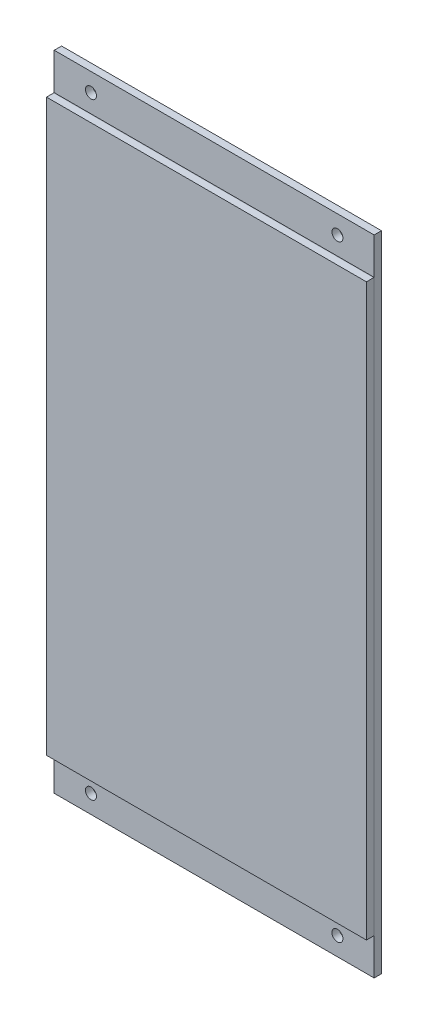
ISO-10303-21;
HEADER;
FILE_DESCRIPTION(('STEP AP214'),'2;1');
FILE_NAME('part.step','',(''),(''),'','','');
FILE_SCHEMA(('AUTOMOTIVE_DESIGN { 1 0 10303 214 1 1 1 1 }'));
ENDSEC;
DATA;
#1=APPLICATION_CONTEXT('core data for automotive mechanical design processes');
#2=APPLICATION_PROTOCOL_DEFINITION('international standard','automotive_design',2000,#1);
#3=PRODUCT_CONTEXT('',#1,'mechanical');
#4=PRODUCT('Part','Part','',(#3));
#5=PRODUCT_RELATED_PRODUCT_CATEGORY('part','',(#4));
#6=PRODUCT_DEFINITION_FORMATION('','',#4);
#7=PRODUCT_DEFINITION_CONTEXT('part definition',#1,'design');
#8=PRODUCT_DEFINITION('design','',#6,#7);
#9=PRODUCT_DEFINITION_SHAPE('','',#8);
#10=(LENGTH_UNIT() NAMED_UNIT(*) SI_UNIT(.MILLI.,.METRE.));
#11=(NAMED_UNIT(*) PLANE_ANGLE_UNIT() SI_UNIT($,.RADIAN.));
#12=(NAMED_UNIT(*) SI_UNIT($,.STERADIAN.) SOLID_ANGLE_UNIT());
#13=UNCERTAINTY_MEASURE_WITH_UNIT(LENGTH_MEASURE(1.E-05),#10,'distance_accuracy_value','');
#14=(GEOMETRIC_REPRESENTATION_CONTEXT(3) GLOBAL_UNCERTAINTY_ASSIGNED_CONTEXT((#13)) GLOBAL_UNIT_ASSIGNED_CONTEXT((#10,
#11,#12)) REPRESENTATION_CONTEXT('',''));
#15=CARTESIAN_POINT('',(0.,0.,0.));
#16=DIRECTION('',(0.,0.,1.));
#17=DIRECTION('',(1.,0.,0.));
#18=AXIS2_PLACEMENT_3D('',#15,#16,#17);
#19=CARTESIAN_POINT('',(-16.521568627451,37.4671078431373,-2.1));
#20=DIRECTION('',(1.,0.,0.));
#21=DIRECTION('',(0.,1.,0.));
#22=AXIS2_PLACEMENT_3D('',#19,#20,#21);
#23=PLANE('',#22);
#24=DIRECTION('',(0.,1.,0.));
#25=VECTOR('',#24,1.);
#26=CARTESIAN_POINT('',(-16.521568627451,37.4671078431373,-0.1));
#27=LINE('',#26,#25);
#28=CARTESIAN_POINT('',(-16.521568627451,-137.732892156863,-0.1));
#29=VERTEX_POINT('',#28);
#30=CARTESIAN_POINT('',(-16.521568627451,37.4671078431373,-0.1));
#31=VERTEX_POINT('',#30);
#32=EDGE_CURVE('E123',#29,#31,#27,.T.);
#33=ORIENTED_EDGE('',*,*,#32,.T.);
#34=DIRECTION('',(0.,0.,1.));
#35=VECTOR('',#34,1.);
#36=CARTESIAN_POINT('',(-16.521568627451,37.4671078431373,-2.1));
#37=LINE('',#36,#35);
#38=CARTESIAN_POINT('',(-16.521568627451,37.4671078431373,-2.1));
#39=VERTEX_POINT('',#38);
#40=EDGE_CURVE('E12',#39,#31,#37,.T.);
#41=ORIENTED_EDGE('',*,*,#40,.F.);
#42=DIRECTION('',(0.,1.,0.));
#43=VECTOR('',#42,1.);
#44=CARTESIAN_POINT('',(-16.521568627451,37.4671078431373,-2.1));
#45=LINE('',#44,#43);
#46=CARTESIAN_POINT('',(-16.521568627451,-137.732892156863,-2.1));
#47=VERTEX_POINT('',#46);
#48=EDGE_CURVE('E107',#47,#39,#45,.T.);
#49=ORIENTED_EDGE('',*,*,#48,.F.);
#50=DIRECTION('',(0.,0.,1.));
#51=VECTOR('',#50,1.);
#52=CARTESIAN_POINT('',(-16.521568627451,-137.732892156863,-2.1));
#53=LINE('',#52,#51);
#54=EDGE_CURVE('E119',#47,#29,#53,.T.);
#55=ORIENTED_EDGE('',*,*,#54,.T.);
#56=EDGE_LOOP('',(#33,#41,#49,#55));
#57=FACE_BOUND('',#56,.T.);
#58=ADVANCED_FACE('F55',(#57),#23,.F.);
#59=CARTESIAN_POINT('',(70.578431372549,37.4671078431373,-2.1));
#60=DIRECTION('',(0.,-1.,0.));
#61=DIRECTION('',(0.,0.,-1.));
#62=AXIS2_PLACEMENT_3D('',#59,#60,#61);
#63=PLANE('',#62);
#64=DIRECTION('',(1.,0.,0.));
#65=VECTOR('',#64,1.);
#66=CARTESIAN_POINT('',(70.578431372549,37.4671078431373,-0.1));
#67=LINE('',#66,#65);
#68=CARTESIAN_POINT('',(70.578431372549,37.4671078431373,-0.1));
#69=VERTEX_POINT('',#68);
#70=EDGE_CURVE('E112',#31,#69,#67,.T.);
#71=ORIENTED_EDGE('',*,*,#70,.T.);
#72=DIRECTION('',(0.,0.,1.));
#73=VECTOR('',#72,1.);
#74=CARTESIAN_POINT('',(70.578431372549,37.4671078431373,-2.1));
#75=LINE('',#74,#73);
#76=CARTESIAN_POINT('',(70.578431372549,37.4671078431373,-2.1));
#77=VERTEX_POINT('',#76);
#78=EDGE_CURVE('E64',#77,#69,#75,.T.);
#79=ORIENTED_EDGE('',*,*,#78,.F.);
#80=DIRECTION('',(1.,0.,0.));
#81=VECTOR('',#80,1.);
#82=CARTESIAN_POINT('',(70.578431372549,37.4671078431373,-2.1));
#83=LINE('',#82,#81);
#84=EDGE_CURVE('E102',#39,#77,#83,.T.);
#85=ORIENTED_EDGE('',*,*,#84,.F.);
#86=ORIENTED_EDGE('',*,*,#40,.T.);
#87=EDGE_LOOP('',(#71,#79,#85,#86));
#88=FACE_BOUND('',#87,.T.);
#89=ADVANCED_FACE('F111',(#88),#63,.F.);
#90=CARTESIAN_POINT('',(70.578431372549,37.4671078431373,-2.1));
#91=DIRECTION('',(-1.,0.,0.));
#92=DIRECTION('',(0.,-1.,0.));
#93=AXIS2_PLACEMENT_3D('',#90,#91,#92);
#94=PLANE('',#93);
#95=DIRECTION('',(0.,-1.,0.));
#96=VECTOR('',#95,1.);
#97=CARTESIAN_POINT('',(70.578431372549,37.4671078431373,-0.1));
#98=LINE('',#97,#96);
#99=CARTESIAN_POINT('',(70.578431372549,-137.732892156863,-0.1));
#100=VERTEX_POINT('',#99);
#101=EDGE_CURVE('E89',#69,#100,#98,.T.);
#102=ORIENTED_EDGE('',*,*,#101,.T.);
#103=DIRECTION('',(0.,0.,1.));
#104=VECTOR('',#103,1.);
#105=CARTESIAN_POINT('',(70.578431372549,-137.732892156863,-2.1));
#106=LINE('',#105,#104);
#107=CARTESIAN_POINT('',(70.578431372549,-137.732892156863,-2.1));
#108=VERTEX_POINT('',#107);
#109=EDGE_CURVE('E114',#108,#100,#106,.T.);
#110=ORIENTED_EDGE('',*,*,#109,.F.);
#111=DIRECTION('',(0.,-1.,0.));
#112=VECTOR('',#111,1.);
#113=CARTESIAN_POINT('',(70.578431372549,37.4671078431373,-2.1));
#114=LINE('',#113,#112);
#115=EDGE_CURVE('E105',#77,#108,#114,.T.);
#116=ORIENTED_EDGE('',*,*,#115,.F.);
#117=ORIENTED_EDGE('',*,*,#78,.T.);
#118=EDGE_LOOP('',(#102,#110,#116,#117));
#119=FACE_BOUND('',#118,.T.);
#120=ADVANCED_FACE('F115',(#119),#94,.F.);
#121=CARTESIAN_POINT('',(70.578431372549,-137.732892156863,-2.1));
#122=DIRECTION('',(0.,1.,0.));
#123=DIRECTION('',(0.,0.,1.));
#124=AXIS2_PLACEMENT_3D('',#121,#122,#123);
#125=PLANE('',#124);
#126=DIRECTION('',(-1.,0.,0.));
#127=VECTOR('',#126,1.);
#128=CARTESIAN_POINT('',(70.578431372549,-137.732892156863,-0.1));
#129=LINE('',#128,#127);
#130=EDGE_CURVE('E95',#100,#29,#129,.T.);
#131=ORIENTED_EDGE('',*,*,#130,.T.);
#132=ORIENTED_EDGE('',*,*,#54,.F.);
#133=DIRECTION('',(-1.,0.,0.));
#134=VECTOR('',#133,1.);
#135=CARTESIAN_POINT('',(70.578431372549,-137.732892156863,-2.1));
#136=LINE('',#135,#134);
#137=EDGE_CURVE('E72',#108,#47,#136,.T.);
#138=ORIENTED_EDGE('',*,*,#137,.F.);
#139=ORIENTED_EDGE('',*,*,#109,.T.);
#140=EDGE_LOOP('',(#131,#132,#138,#139));
#141=FACE_BOUND('',#140,.T.);
#142=ADVANCED_FACE('F137',(#141),#125,.F.);
#143=CARTESIAN_POINT('',(0.,0.,-2.1));
#144=DIRECTION('',(0.,0.,-1.));
#145=DIRECTION('',(-1.,0.,0.));
#146=AXIS2_PLACEMENT_3D('',#143,#144,#145);
#147=PLANE('',#146);
#148=CARTESIAN_POINT('',(60.578431372549,32.4671078431373,-2.1));
#149=DIRECTION('',(0.,0.,1.));
#150=DIRECTION('',(1.,0.,0.));
#151=AXIS2_PLACEMENT_3D('',#148,#149,#150);
#152=CIRCLE('',#151,1.5);
#153=CARTESIAN_POINT('',(62.078431372549,32.4671078431373,-2.1));
#154=VERTEX_POINT('',#153);
#155=EDGE_CURVE('E161',#154,#154,#152,.T.);
#156=ORIENTED_EDGE('',*,*,#155,.T.);
#157=EDGE_LOOP('',(#156));
#158=FACE_BOUND('',#157,.T.);
#159=CARTESIAN_POINT('',(-6.52156862745098,-132.732892156863,-2.1));
#160=DIRECTION('',(0.,0.,1.));
#161=DIRECTION('',(1.,0.,0.));
#162=AXIS2_PLACEMENT_3D('',#159,#160,#161);
#163=CIRCLE('',#162,1.5);
#164=CARTESIAN_POINT('',(-5.02156862745098,-132.732892156863,-2.1));
#165=VERTEX_POINT('',#164);
#166=EDGE_CURVE('E152',#165,#165,#163,.T.);
#167=ORIENTED_EDGE('',*,*,#166,.T.);
#168=EDGE_LOOP('',(#167));
#169=FACE_BOUND('',#168,.T.);
#170=CARTESIAN_POINT('',(60.578431372549,-132.732892156863,-2.1));
#171=DIRECTION('',(0.,0.,1.));
#172=DIRECTION('',(1.,0.,0.));
#173=AXIS2_PLACEMENT_3D('',#170,#171,#172);
#174=CIRCLE('',#173,1.5);
#175=CARTESIAN_POINT('',(62.078431372549,-132.732892156863,-2.1));
#176=VERTEX_POINT('',#175);
#177=EDGE_CURVE('E168',#176,#176,#174,.T.);
#178=ORIENTED_EDGE('',*,*,#177,.T.);
#179=EDGE_LOOP('',(#178));
#180=FACE_BOUND('',#179,.T.);
#181=CARTESIAN_POINT('',(-6.52156862745098,32.4671078431372,-2.1));
#182=DIRECTION('',(0.,0.,1.));
#183=DIRECTION('',(1.,0.,0.));
#184=AXIS2_PLACEMENT_3D('',#181,#182,#183);
#185=CIRCLE('',#184,1.5);
#186=CARTESIAN_POINT('',(-5.02156862745098,32.4671078431372,-2.1));
#187=VERTEX_POINT('',#186);
#188=EDGE_CURVE('E127',#187,#187,#185,.T.);
#189=ORIENTED_EDGE('',*,*,#188,.T.);
#190=EDGE_LOOP('',(#189));
#191=FACE_BOUND('',#190,.T.);
#192=ORIENTED_EDGE('',*,*,#48,.T.);
#193=ORIENTED_EDGE('',*,*,#84,.T.);
#194=ORIENTED_EDGE('',*,*,#115,.T.);
#195=ORIENTED_EDGE('',*,*,#137,.T.);
#196=EDGE_LOOP('',(#192,#193,#194,#195));
#197=FACE_BOUND('',#196,.T.);
#198=ADVANCED_FACE('F103',(#158,#169,#180,#191,#197),#147,.T.);
#199=CARTESIAN_POINT('',(0.,0.,-0.1));
#200=DIRECTION('',(0.,0.,-1.));
#201=DIRECTION('',(-1.,0.,0.));
#202=AXIS2_PLACEMENT_3D('',#199,#200,#201);
#203=PLANE('',#202);
#204=CARTESIAN_POINT('',(60.578431372549,32.4671078431373,-0.1));
#205=DIRECTION('',(0.,0.,1.));
#206=DIRECTION('',(1.,0.,0.));
#207=AXIS2_PLACEMENT_3D('',#204,#205,#206);
#208=CIRCLE('',#207,1.5);
#209=CARTESIAN_POINT('',(62.078431372549,32.4671078431373,-0.1));
#210=VERTEX_POINT('',#209);
#211=EDGE_CURVE('E148',#210,#210,#208,.T.);
#212=ORIENTED_EDGE('',*,*,#211,.F.);
#213=EDGE_LOOP('',(#212));
#214=FACE_BOUND('',#213,.T.);
#215=CARTESIAN_POINT('',(-6.52156862745098,-132.732892156863,-0.1));
#216=DIRECTION('',(0.,0.,1.));
#217=DIRECTION('',(1.,0.,0.));
#218=AXIS2_PLACEMENT_3D('',#215,#216,#217);
#219=CIRCLE('',#218,1.5);
#220=CARTESIAN_POINT('',(-5.02156862745098,-132.732892156863,-0.1));
#221=VERTEX_POINT('',#220);
#222=EDGE_CURVE('E156',#221,#221,#219,.T.);
#223=ORIENTED_EDGE('',*,*,#222,.F.);
#224=EDGE_LOOP('',(#223));
#225=FACE_BOUND('',#224,.T.);
#226=CARTESIAN_POINT('',(60.578431372549,-132.732892156863,-0.1));
#227=DIRECTION('',(0.,0.,1.));
#228=DIRECTION('',(1.,0.,0.));
#229=AXIS2_PLACEMENT_3D('',#226,#227,#228);
#230=CIRCLE('',#229,1.5);
#231=CARTESIAN_POINT('',(62.078431372549,-132.732892156863,-0.1));
#232=VERTEX_POINT('',#231);
#233=EDGE_CURVE('E157',#232,#232,#230,.T.);
#234=ORIENTED_EDGE('',*,*,#233,.F.);
#235=EDGE_LOOP('',(#234));
#236=FACE_BOUND('',#235,.T.);
#237=CARTESIAN_POINT('',(-6.52156862745098,32.4671078431372,-0.1));
#238=DIRECTION('',(0.,0.,1.));
#239=DIRECTION('',(1.,0.,0.));
#240=AXIS2_PLACEMENT_3D('',#237,#238,#239);
#241=CIRCLE('',#240,1.5);
#242=CARTESIAN_POINT('',(-5.02156862745098,32.4671078431372,-0.1));
#243=VERTEX_POINT('',#242);
#244=EDGE_CURVE('E144',#243,#243,#241,.T.);
#245=ORIENTED_EDGE('',*,*,#244,.F.);
#246=EDGE_LOOP('',(#245));
#247=FACE_BOUND('',#246,.T.);
#248=ORIENTED_EDGE('',*,*,#32,.F.);
#249=ORIENTED_EDGE('',*,*,#130,.F.);
#250=ORIENTED_EDGE('',*,*,#101,.F.);
#251=ORIENTED_EDGE('',*,*,#70,.F.);
#252=EDGE_LOOP('',(#248,#249,#250,#251));
#253=FACE_BOUND('',#252,.T.);
#254=ADVANCED_FACE('F140',(#214,#225,#236,#247,#253),#203,.F.);
#255=CARTESIAN_POINT('',(-6.52156862745098,32.4671078431372,-2.1));
#256=DIRECTION('',(0.,0.,1.));
#257=DIRECTION('',(1.,0.,0.));
#258=AXIS2_PLACEMENT_3D('',#255,#256,#257);
#259=CYLINDRICAL_SURFACE('',#258,1.5);
#260=ORIENTED_EDGE('',*,*,#188,.F.);
#261=EDGE_LOOP('',(#260));
#262=FACE_BOUND('',#261,.T.);
#263=ORIENTED_EDGE('',*,*,#244,.T.);
#264=EDGE_LOOP('',(#263));
#265=FACE_BOUND('',#264,.T.);
#266=ADVANCED_FACE('F180',(#262,#265),#259,.F.);
#267=CARTESIAN_POINT('',(60.578431372549,-132.732892156863,-2.1));
#268=DIRECTION('',(0.,0.,1.));
#269=DIRECTION('',(1.,0.,0.));
#270=AXIS2_PLACEMENT_3D('',#267,#268,#269);
#271=CYLINDRICAL_SURFACE('',#270,1.5);
#272=ORIENTED_EDGE('',*,*,#177,.F.);
#273=EDGE_LOOP('',(#272));
#274=FACE_BOUND('',#273,.T.);
#275=ORIENTED_EDGE('',*,*,#233,.T.);
#276=EDGE_LOOP('',(#275));
#277=FACE_BOUND('',#276,.T.);
#278=ADVANCED_FACE('F176',(#274,#277),#271,.F.);
#279=CARTESIAN_POINT('',(-6.52156862745098,-132.732892156863,-2.1));
#280=DIRECTION('',(0.,0.,1.));
#281=DIRECTION('',(1.,0.,0.));
#282=AXIS2_PLACEMENT_3D('',#279,#280,#281);
#283=CYLINDRICAL_SURFACE('',#282,1.5);
#284=ORIENTED_EDGE('',*,*,#166,.F.);
#285=EDGE_LOOP('',(#284));
#286=FACE_BOUND('',#285,.T.);
#287=ORIENTED_EDGE('',*,*,#222,.T.);
#288=EDGE_LOOP('',(#287));
#289=FACE_BOUND('',#288,.T.);
#290=ADVANCED_FACE('F192',(#286,#289),#283,.F.);
#291=CARTESIAN_POINT('',(60.578431372549,32.4671078431373,-2.1));
#292=DIRECTION('',(0.,0.,1.));
#293=DIRECTION('',(1.,0.,0.));
#294=AXIS2_PLACEMENT_3D('',#291,#292,#293);
#295=CYLINDRICAL_SURFACE('',#294,1.5);
#296=ORIENTED_EDGE('',*,*,#155,.F.);
#297=EDGE_LOOP('',(#296));
#298=FACE_BOUND('',#297,.T.);
#299=ORIENTED_EDGE('',*,*,#211,.T.);
#300=EDGE_LOOP('',(#299));
#301=FACE_BOUND('',#300,.T.);
#302=ADVANCED_FACE('F222',(#298,#301),#295,.F.);
#303=CLOSED_SHELL('',(#58,#89,#120,#142,#198,#254,#266,#278,#290,#302));
#304=MANIFOLD_SOLID_BREP('B2',#303);
#305=CARTESIAN_POINT('',(70.578431372549,27.4671078431373,-0.1));
#306=DIRECTION('',(-1.,0.,0.));
#307=DIRECTION('',(0.,0.,1.));
#308=AXIS2_PLACEMENT_3D('',#305,#306,#307);
#309=PLANE('',#308);
#310=DIRECTION('',(0.,-1.,0.));
#311=VECTOR('',#310,1.);
#312=CARTESIAN_POINT('',(70.578431372549,27.4671078431373,0.));
#313=LINE('',#312,#311);
#314=CARTESIAN_POINT('',(70.578431372549,27.4671078431373,0.));
#315=VERTEX_POINT('',#314);
#316=CARTESIAN_POINT('',(70.578431372549,-127.732892156863,0.));
#317=VERTEX_POINT('',#316);
#318=EDGE_CURVE('E374',#315,#317,#313,.T.);
#319=ORIENTED_EDGE('',*,*,#318,.T.);
#320=DIRECTION('',(0.,0.,1.));
#321=VECTOR('',#320,1.);
#322=CARTESIAN_POINT('',(70.578431372549,-127.732892156863,-0.1));
#323=LINE('',#322,#321);
#324=CARTESIAN_POINT('',(70.578431372549,-127.732892156863,-0.1));
#325=VERTEX_POINT('',#324);
#326=EDGE_CURVE('E53',#325,#317,#323,.T.);
#327=ORIENTED_EDGE('',*,*,#326,.F.);
#328=DIRECTION('',(0.,-1.,0.));
#329=VECTOR('',#328,1.);
#330=CARTESIAN_POINT('',(70.578431372549,27.4671078431373,-0.1));
#331=LINE('',#330,#329);
#332=CARTESIAN_POINT('',(70.578431372549,27.4671078431373,-0.1));
#333=VERTEX_POINT('',#332);
#334=EDGE_CURVE('E362',#333,#325,#331,.T.);
#335=ORIENTED_EDGE('',*,*,#334,.F.);
#336=DIRECTION('',(0.,0.,1.));
#337=VECTOR('',#336,1.);
#338=CARTESIAN_POINT('',(70.578431372549,27.4671078431373,-0.1));
#339=LINE('',#338,#337);
#340=EDGE_CURVE('E370',#333,#315,#339,.T.);
#341=ORIENTED_EDGE('',*,*,#340,.T.);
#342=EDGE_LOOP('',(#319,#327,#335,#341));
#343=FACE_BOUND('',#342,.T.);
#344=ADVANCED_FACE('F311',(#343),#309,.F.);
#345=CARTESIAN_POINT('',(70.578431372549,-127.732892156863,-0.1));
#346=DIRECTION('',(0.,1.,0.));
#347=DIRECTION('',(0.,0.,1.));
#348=AXIS2_PLACEMENT_3D('',#345,#346,#347);
#349=PLANE('',#348);
#350=DIRECTION('',(-1.,0.,0.));
#351=VECTOR('',#350,1.);
#352=CARTESIAN_POINT('',(70.578431372549,-127.732892156863,0.));
#353=LINE('',#352,#351);
#354=CARTESIAN_POINT('',(-16.521568627451,-127.732892156863,0.));
#355=VERTEX_POINT('',#354);
#356=EDGE_CURVE('E366',#317,#355,#353,.T.);
#357=ORIENTED_EDGE('',*,*,#356,.T.);
#358=DIRECTION('',(0.,0.,1.));
#359=VECTOR('',#358,1.);
#360=CARTESIAN_POINT('',(-16.521568627451,-127.732892156863,-0.1));
#361=LINE('',#360,#359);
#362=CARTESIAN_POINT('',(-16.521568627451,-127.732892156863,-0.1));
#363=VERTEX_POINT('',#362);
#364=EDGE_CURVE('E319',#363,#355,#361,.T.);
#365=ORIENTED_EDGE('',*,*,#364,.F.);
#366=DIRECTION('',(-1.,0.,0.));
#367=VECTOR('',#366,1.);
#368=CARTESIAN_POINT('',(70.578431372549,-127.732892156863,-0.1));
#369=LINE('',#368,#367);
#370=EDGE_CURVE('E357',#325,#363,#369,.T.);
#371=ORIENTED_EDGE('',*,*,#370,.F.);
#372=ORIENTED_EDGE('',*,*,#326,.T.);
#373=EDGE_LOOP('',(#357,#365,#371,#372));
#374=FACE_BOUND('',#373,.T.);
#375=ADVANCED_FACE('F365',(#374),#349,.F.);
#376=CARTESIAN_POINT('',(-16.521568627451,27.4671078431373,-0.1));
#377=DIRECTION('',(1.,0.,0.));
#378=DIRECTION('',(0.,0.,-1.));
#379=AXIS2_PLACEMENT_3D('',#376,#377,#378);
#380=PLANE('',#379);
#381=DIRECTION('',(0.,1.,0.));
#382=VECTOR('',#381,1.);
#383=CARTESIAN_POINT('',(-16.521568627451,27.4671078431373,0.));
#384=LINE('',#383,#382);
#385=CARTESIAN_POINT('',(-16.521568627451,27.4671078431373,0.));
#386=VERTEX_POINT('',#385);
#387=EDGE_CURVE('E344',#355,#386,#384,.T.);
#388=ORIENTED_EDGE('',*,*,#387,.T.);
#389=DIRECTION('',(0.,0.,1.));
#390=VECTOR('',#389,1.);
#391=CARTESIAN_POINT('',(-16.521568627451,27.4671078431373,-0.1));
#392=LINE('',#391,#390);
#393=CARTESIAN_POINT('',(-16.521568627451,27.4671078431373,-0.1));
#394=VERTEX_POINT('',#393);
#395=EDGE_CURVE('E367',#394,#386,#392,.T.);
#396=ORIENTED_EDGE('',*,*,#395,.F.);
#397=DIRECTION('',(0.,1.,0.));
#398=VECTOR('',#397,1.);
#399=CARTESIAN_POINT('',(-16.521568627451,27.4671078431373,-0.1));
#400=LINE('',#399,#398);
#401=EDGE_CURVE('E360',#363,#394,#400,.T.);
#402=ORIENTED_EDGE('',*,*,#401,.F.);
#403=ORIENTED_EDGE('',*,*,#364,.T.);
#404=EDGE_LOOP('',(#388,#396,#402,#403));
#405=FACE_BOUND('',#404,.T.);
#406=ADVANCED_FACE('F368',(#405),#380,.F.);
#407=CARTESIAN_POINT('',(70.578431372549,27.4671078431373,-0.1));
#408=DIRECTION('',(0.,-1.,0.));
#409=DIRECTION('',(0.,0.,-1.));
#410=AXIS2_PLACEMENT_3D('',#407,#408,#409);
#411=PLANE('',#410);
#412=DIRECTION('',(1.,0.,0.));
#413=VECTOR('',#412,1.);
#414=CARTESIAN_POINT('',(70.578431372549,27.4671078431373,0.));
#415=LINE('',#414,#413);
#416=EDGE_CURVE('E350',#386,#315,#415,.T.);
#417=ORIENTED_EDGE('',*,*,#416,.T.);
#418=ORIENTED_EDGE('',*,*,#340,.F.);
#419=DIRECTION('',(1.,0.,0.));
#420=VECTOR('',#419,1.);
#421=CARTESIAN_POINT('',(70.578431372549,27.4671078431373,-0.1));
#422=LINE('',#421,#420);
#423=EDGE_CURVE('E327',#394,#333,#422,.T.);
#424=ORIENTED_EDGE('',*,*,#423,.F.);
#425=ORIENTED_EDGE('',*,*,#395,.T.);
#426=EDGE_LOOP('',(#417,#418,#424,#425));
#427=FACE_BOUND('',#426,.T.);
#428=ADVANCED_FACE('F381',(#427),#411,.F.);
#429=CARTESIAN_POINT('',(0.,0.,-0.1));
#430=DIRECTION('',(0.,0.,-1.));
#431=DIRECTION('',(-1.,0.,0.));
#432=AXIS2_PLACEMENT_3D('',#429,#430,#431);
#433=PLANE('',#432);
#434=ORIENTED_EDGE('',*,*,#334,.T.);
#435=ORIENTED_EDGE('',*,*,#370,.T.);
#436=ORIENTED_EDGE('',*,*,#401,.T.);
#437=ORIENTED_EDGE('',*,*,#423,.T.);
#438=EDGE_LOOP('',(#434,#435,#436,#437));
#439=FACE_BOUND('',#438,.T.);
#440=ADVANCED_FACE('F358',(#439),#433,.T.);
#441=CARTESIAN_POINT('',(0.,0.,0.));
#442=DIRECTION('',(0.,0.,-1.));
#443=DIRECTION('',(-1.,0.,0.));
#444=AXIS2_PLACEMENT_3D('',#441,#442,#443);
#445=PLANE('',#444);
#446=ORIENTED_EDGE('',*,*,#318,.F.);
#447=ORIENTED_EDGE('',*,*,#416,.F.);
#448=ORIENTED_EDGE('',*,*,#387,.F.);
#449=ORIENTED_EDGE('',*,*,#356,.F.);
#450=EDGE_LOOP('',(#446,#447,#448,#449));
#451=FACE_BOUND('',#450,.T.);
#452=ADVANCED_FACE('F384',(#451),#445,.F.);
#453=CLOSED_SHELL('',(#344,#375,#406,#428,#440,#452));
#454=MANIFOLD_SOLID_BREP('B6',#453);
#455=CARTESIAN_POINT('',(-16.521568627451,27.4671078431373,2.));
#456=DIRECTION('',(1.,0.,0.));
#457=DIRECTION('',(0.,1.,0.));
#458=AXIS2_PLACEMENT_3D('',#455,#456,#457);
#459=PLANE('',#458);
#460=DIRECTION('',(0.,-1.,0.));
#461=VECTOR('',#460,1.);
#462=CARTESIAN_POINT('',(-16.521568627451,27.4671078431373,0.));
#463=LINE('',#462,#461);
#464=CARTESIAN_POINT('',(-16.521568627451,27.4671078431373,0.));
#465=VERTEX_POINT('',#464);
#466=CARTESIAN_POINT('',(-16.521568627451,-127.732892156863,0.));
#467=VERTEX_POINT('',#466);
#468=EDGE_CURVE('E509',#465,#467,#463,.T.);
#469=ORIENTED_EDGE('',*,*,#468,.T.);
#470=DIRECTION('',(0.,0.,-1.));
#471=VECTOR('',#470,1.);
#472=CARTESIAN_POINT('',(-16.521568627451,-127.732892156863,2.));
#473=LINE('',#472,#471);
#474=CARTESIAN_POINT('',(-16.521568627451,-127.732892156863,2.));
#475=VERTEX_POINT('',#474);
#476=EDGE_CURVE('E309',#475,#467,#473,.T.);
#477=ORIENTED_EDGE('',*,*,#476,.F.);
#478=DIRECTION('',(0.,-1.,0.));
#479=VECTOR('',#478,1.);
#480=CARTESIAN_POINT('',(-16.521568627451,27.4671078431373,2.));
#481=LINE('',#480,#479);
#482=CARTESIAN_POINT('',(-16.521568627451,27.4671078431373,2.));
#483=VERTEX_POINT('',#482);
#484=EDGE_CURVE('E497',#483,#475,#481,.T.);
#485=ORIENTED_EDGE('',*,*,#484,.F.);
#486=DIRECTION('',(0.,0.,-1.));
#487=VECTOR('',#486,1.);
#488=CARTESIAN_POINT('',(-16.521568627451,27.4671078431373,2.));
#489=LINE('',#488,#487);
#490=EDGE_CURVE('E505',#483,#465,#489,.T.);
#491=ORIENTED_EDGE('',*,*,#490,.T.);
#492=EDGE_LOOP('',(#469,#477,#485,#491));
#493=FACE_BOUND('',#492,.T.);
#494=ADVANCED_FACE('F446',(#493),#459,.F.);
#495=CARTESIAN_POINT('',(-16.521568627451,-127.732892156863,2.));
#496=DIRECTION('',(0.,1.,0.));
#497=DIRECTION('',(0.,0.,1.));
#498=AXIS2_PLACEMENT_3D('',#495,#496,#497);
#499=PLANE('',#498);
#500=DIRECTION('',(1.,0.,0.));
#501=VECTOR('',#500,1.);
#502=CARTESIAN_POINT('',(-16.521568627451,-127.732892156863,0.));
#503=LINE('',#502,#501);
#504=CARTESIAN_POINT('',(70.578431372549,-127.732892156863,0.));
#505=VERTEX_POINT('',#504);
#506=EDGE_CURVE('E501',#467,#505,#503,.T.);
#507=ORIENTED_EDGE('',*,*,#506,.T.);
#508=DIRECTION('',(0.,0.,-1.));
#509=VECTOR('',#508,1.);
#510=CARTESIAN_POINT('',(70.578431372549,-127.732892156863,2.));
#511=LINE('',#510,#509);
#512=CARTESIAN_POINT('',(70.578431372549,-127.732892156863,2.));
#513=VERTEX_POINT('',#512);
#514=EDGE_CURVE('E454',#513,#505,#511,.T.);
#515=ORIENTED_EDGE('',*,*,#514,.F.);
#516=DIRECTION('',(1.,0.,0.));
#517=VECTOR('',#516,1.);
#518=CARTESIAN_POINT('',(-16.521568627451,-127.732892156863,2.));
#519=LINE('',#518,#517);
#520=EDGE_CURVE('E492',#475,#513,#519,.T.);
#521=ORIENTED_EDGE('',*,*,#520,.F.);
#522=ORIENTED_EDGE('',*,*,#476,.T.);
#523=EDGE_LOOP('',(#507,#515,#521,#522));
#524=FACE_BOUND('',#523,.T.);
#525=ADVANCED_FACE('F500',(#524),#499,.F.);
#526=CARTESIAN_POINT('',(70.578431372549,27.4671078431373,2.));
#527=DIRECTION('',(-1.,0.,0.));
#528=DIRECTION('',(0.,-1.,0.));
#529=AXIS2_PLACEMENT_3D('',#526,#527,#528);
#530=PLANE('',#529);
#531=DIRECTION('',(0.,1.,0.));
#532=VECTOR('',#531,1.);
#533=CARTESIAN_POINT('',(70.578431372549,27.4671078431373,0.));
#534=LINE('',#533,#532);
#535=CARTESIAN_POINT('',(70.578431372549,27.4671078431373,0.));
#536=VERTEX_POINT('',#535);
#537=EDGE_CURVE('E479',#505,#536,#534,.T.);
#538=ORIENTED_EDGE('',*,*,#537,.T.);
#539=DIRECTION('',(0.,0.,-1.));
#540=VECTOR('',#539,1.);
#541=CARTESIAN_POINT('',(70.578431372549,27.4671078431373,2.));
#542=LINE('',#541,#540);
#543=CARTESIAN_POINT('',(70.578431372549,27.4671078431373,2.));
#544=VERTEX_POINT('',#543);
#545=EDGE_CURVE('E502',#544,#536,#542,.T.);
#546=ORIENTED_EDGE('',*,*,#545,.F.);
#547=DIRECTION('',(0.,1.,0.));
#548=VECTOR('',#547,1.);
#549=CARTESIAN_POINT('',(70.578431372549,27.4671078431373,2.));
#550=LINE('',#549,#548);
#551=EDGE_CURVE('E495',#513,#544,#550,.T.);
#552=ORIENTED_EDGE('',*,*,#551,.F.);
#553=ORIENTED_EDGE('',*,*,#514,.T.);
#554=EDGE_LOOP('',(#538,#546,#552,#553));
#555=FACE_BOUND('',#554,.T.);
#556=ADVANCED_FACE('F503',(#555),#530,.F.);
#557=CARTESIAN_POINT('',(-16.521568627451,27.4671078431373,2.));
#558=DIRECTION('',(0.,-1.,0.));
#559=DIRECTION('',(0.,0.,-1.));
#560=AXIS2_PLACEMENT_3D('',#557,#558,#559);
#561=PLANE('',#560);
#562=DIRECTION('',(-1.,0.,0.));
#563=VECTOR('',#562,1.);
#564=CARTESIAN_POINT('',(-16.521568627451,27.4671078431373,0.));
#565=LINE('',#564,#563);
#566=EDGE_CURVE('E485',#536,#465,#565,.T.);
#567=ORIENTED_EDGE('',*,*,#566,.T.);
#568=ORIENTED_EDGE('',*,*,#490,.F.);
#569=DIRECTION('',(-1.,0.,0.));
#570=VECTOR('',#569,1.);
#571=CARTESIAN_POINT('',(-16.521568627451,27.4671078431373,2.));
#572=LINE('',#571,#570);
#573=EDGE_CURVE('E462',#544,#483,#572,.T.);
#574=ORIENTED_EDGE('',*,*,#573,.F.);
#575=ORIENTED_EDGE('',*,*,#545,.T.);
#576=EDGE_LOOP('',(#567,#568,#574,#575));
#577=FACE_BOUND('',#576,.T.);
#578=ADVANCED_FACE('F516',(#577),#561,.F.);
#579=CARTESIAN_POINT('',(0.,0.,2.));
#580=DIRECTION('',(0.,0.,1.));
#581=DIRECTION('',(1.,0.,0.));
#582=AXIS2_PLACEMENT_3D('',#579,#580,#581);
#583=PLANE('',#582);
#584=ORIENTED_EDGE('',*,*,#484,.T.);
#585=ORIENTED_EDGE('',*,*,#520,.T.);
#586=ORIENTED_EDGE('',*,*,#551,.T.);
#587=ORIENTED_EDGE('',*,*,#573,.T.);
#588=EDGE_LOOP('',(#584,#585,#586,#587));
#589=FACE_BOUND('',#588,.T.);
#590=ADVANCED_FACE('F493',(#589),#583,.T.);
#591=CARTESIAN_POINT('',(0.,0.,0.));
#592=DIRECTION('',(0.,0.,1.));
#593=DIRECTION('',(1.,0.,0.));
#594=AXIS2_PLACEMENT_3D('',#591,#592,#593);
#595=PLANE('',#594);
#596=ORIENTED_EDGE('',*,*,#468,.F.);
#597=ORIENTED_EDGE('',*,*,#566,.F.);
#598=ORIENTED_EDGE('',*,*,#537,.F.);
#599=ORIENTED_EDGE('',*,*,#506,.F.);
#600=EDGE_LOOP('',(#596,#597,#598,#599));
#601=FACE_BOUND('',#600,.T.);
#602=ADVANCED_FACE('F519',(#601),#595,.F.);
#603=CLOSED_SHELL('',(#494,#525,#556,#578,#590,#602));
#604=MANIFOLD_SOLID_BREP('B47',#603);
#605=ADVANCED_BREP_SHAPE_REPRESENTATION('',(#18,#304,#454,#604),#14);
#606=SHAPE_DEFINITION_REPRESENTATION(#9,#605);
ENDSEC;
END-ISO-10303-21;
